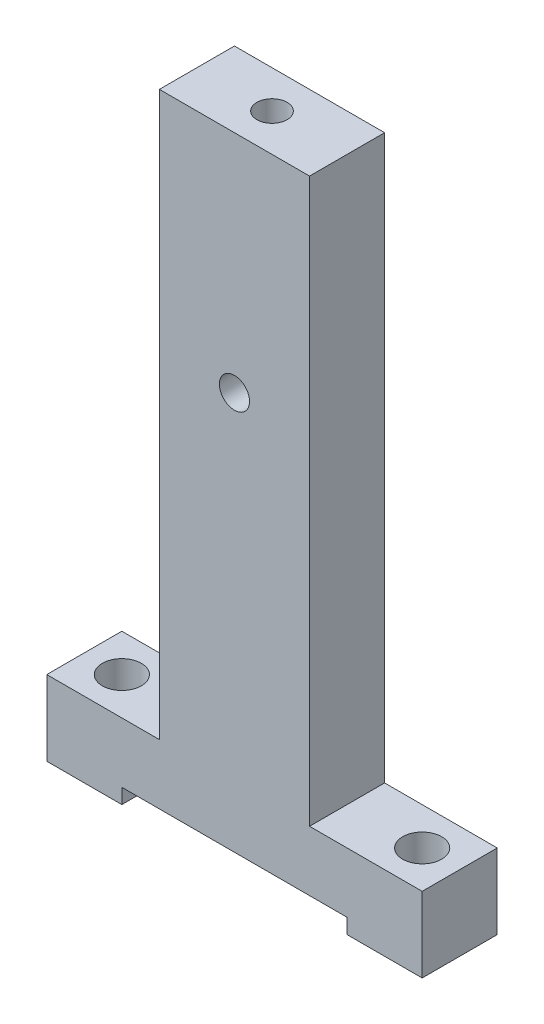
ISO-10303-21;
HEADER;
FILE_DESCRIPTION(('STEP AP214'),'2;1');
FILE_NAME('part.step','',(''),(''),'','','');
FILE_SCHEMA(('AUTOMOTIVE_DESIGN { 1 0 10303 214 1 1 1 1 }'));
ENDSEC;
DATA;
#1=APPLICATION_CONTEXT('core data for automotive mechanical design processes');
#2=APPLICATION_PROTOCOL_DEFINITION('international standard','automotive_design',2000,#1);
#3=PRODUCT_CONTEXT('',#1,'mechanical');
#4=PRODUCT('Part','Part','',(#3));
#5=PRODUCT_RELATED_PRODUCT_CATEGORY('part','',(#4));
#6=PRODUCT_DEFINITION_FORMATION('','',#4);
#7=PRODUCT_DEFINITION_CONTEXT('part definition',#1,'design');
#8=PRODUCT_DEFINITION('design','',#6,#7);
#9=PRODUCT_DEFINITION_SHAPE('','',#8);
#10=(LENGTH_UNIT() NAMED_UNIT(*) SI_UNIT(.MILLI.,.METRE.));
#11=(NAMED_UNIT(*) PLANE_ANGLE_UNIT() SI_UNIT($,.RADIAN.));
#12=(NAMED_UNIT(*) SI_UNIT($,.STERADIAN.) SOLID_ANGLE_UNIT());
#13=UNCERTAINTY_MEASURE_WITH_UNIT(LENGTH_MEASURE(1.E-05),#10,'distance_accuracy_value','');
#14=(GEOMETRIC_REPRESENTATION_CONTEXT(3) GLOBAL_UNCERTAINTY_ASSIGNED_CONTEXT((#13)) GLOBAL_UNIT_ASSIGNED_CONTEXT((#10,
#11,#12)) REPRESENTATION_CONTEXT('',''));
#15=CARTESIAN_POINT('',(0.,0.,0.));
#16=DIRECTION('',(0.,0.,1.));
#17=DIRECTION('',(1.,0.,0.));
#18=AXIS2_PLACEMENT_3D('',#15,#16,#17);
#19=CARTESIAN_POINT('',(0.,-53.975,0.));
#20=DIRECTION('',(0.,1.,0.));
#21=DIRECTION('',(0.,0.,1.));
#22=AXIS2_PLACEMENT_3D('',#19,#20,#21);
#23=PLANE('',#22);
#24=CARTESIAN_POINT('',(-25.4,-53.975,0.));
#25=DIRECTION('',(0.,1.,0.));
#26=DIRECTION('',(0.,0.,1.));
#27=AXIS2_PLACEMENT_3D('',#24,#25,#26);
#28=CIRCLE('',#27,3.302);
#29=CARTESIAN_POINT('',(-25.4,-53.975,3.302));
#30=VERTEX_POINT('',#29);
#31=EDGE_CURVE('E195',#30,#30,#28,.T.);
#32=ORIENTED_EDGE('',*,*,#31,.T.);
#33=EDGE_LOOP('',(#32));
#34=FACE_BOUND('',#33,.T.);
#35=DIRECTION('',(-1.,0.,0.));
#36=VECTOR('',#35,1.);
#37=CARTESIAN_POINT('',(-31.75,-53.975,-6.35));
#38=LINE('',#37,#36);
#39=CARTESIAN_POINT('',(-19.05,-53.975,-6.35));
#40=VERTEX_POINT('',#39);
#41=CARTESIAN_POINT('',(-31.75,-53.975,-6.35));
#42=VERTEX_POINT('',#41);
#43=EDGE_CURVE('E147',#40,#42,#38,.T.);
#44=ORIENTED_EDGE('',*,*,#43,.F.);
#45=DIRECTION('',(0.,0.,1.));
#46=VECTOR('',#45,1.);
#47=CARTESIAN_POINT('',(-19.05,-53.975,-6.35));
#48=LINE('',#47,#46);
#49=CARTESIAN_POINT('',(-19.05,-53.975,6.35));
#50=VERTEX_POINT('',#49);
#51=EDGE_CURVE('E130',#40,#50,#48,.T.);
#52=ORIENTED_EDGE('',*,*,#51,.T.);
#53=DIRECTION('',(1.,0.,0.));
#54=VECTOR('',#53,1.);
#55=CARTESIAN_POINT('',(-31.75,-53.975,6.35));
#56=LINE('',#55,#54);
#57=CARTESIAN_POINT('',(-31.75,-53.975,6.35));
#58=VERTEX_POINT('',#57);
#59=EDGE_CURVE('E161',#58,#50,#56,.T.);
#60=ORIENTED_EDGE('',*,*,#59,.F.);
#61=DIRECTION('',(0.,0.,1.));
#62=VECTOR('',#61,1.);
#63=CARTESIAN_POINT('',(-31.75,-53.975,-6.35));
#64=LINE('',#63,#62);
#65=EDGE_CURVE('E154',#42,#58,#64,.T.);
#66=ORIENTED_EDGE('',*,*,#65,.F.);
#67=EDGE_LOOP('',(#44,#52,#60,#66));
#68=FACE_BOUND('',#67,.T.);
#69=ADVANCED_FACE('F38',(#34,#68),#23,.F.);
#70=CARTESIAN_POINT('',(-31.75,53.975,-6.35));
#71=DIRECTION('',(1.,0.,0.));
#72=DIRECTION('',(0.,0.,-1.));
#73=AXIS2_PLACEMENT_3D('',#70,#71,#72);
#74=PLANE('',#73);
#75=DIRECTION('',(0.,-1.,0.));
#76=VECTOR('',#75,1.);
#77=CARTESIAN_POINT('',(-31.75,53.975,6.35));
#78=LINE('',#77,#76);
#79=CARTESIAN_POINT('',(-31.75,-41.275,6.35));
#80=VERTEX_POINT('',#79);
#81=EDGE_CURVE('E11',#80,#58,#78,.T.);
#82=ORIENTED_EDGE('',*,*,#81,.F.);
#83=DIRECTION('',(0.,0.,1.));
#84=VECTOR('',#83,1.);
#85=CARTESIAN_POINT('',(-31.75,-41.275,-6.351));
#86=LINE('',#85,#84);
#87=CARTESIAN_POINT('',(-31.75,-41.275,-6.35));
#88=VERTEX_POINT('',#87);
#89=EDGE_CURVE('E213',#88,#80,#86,.T.);
#90=ORIENTED_EDGE('',*,*,#89,.F.);
#91=DIRECTION('',(0.,-1.,0.));
#92=VECTOR('',#91,1.);
#93=CARTESIAN_POINT('',(-31.75,53.975,-6.35));
#94=LINE('',#93,#92);
#95=EDGE_CURVE('E165',#88,#42,#94,.T.);
#96=ORIENTED_EDGE('',*,*,#95,.T.);
#97=ORIENTED_EDGE('',*,*,#65,.T.);
#98=EDGE_LOOP('',(#82,#90,#96,#97));
#99=FACE_BOUND('',#98,.T.);
#100=ADVANCED_FACE('F40',(#99),#74,.F.);
#101=CARTESIAN_POINT('',(-31.75,53.975,6.35));
#102=DIRECTION('',(0.,0.,-1.));
#103=DIRECTION('',(-1.,0.,0.));
#104=AXIS2_PLACEMENT_3D('',#101,#102,#103);
#105=PLANE('',#104);
#106=CARTESIAN_POINT('',(0.,15.875,6.35));
#107=DIRECTION('',(0.,0.,1.));
#108=DIRECTION('',(1.,0.,0.));
#109=AXIS2_PLACEMENT_3D('',#106,#107,#108);
#110=CIRCLE('',#109,2.55269999999999);
#111=CARTESIAN_POINT('',(2.55269999999999,15.875,6.35));
#112=VERTEX_POINT('',#111);
#113=EDGE_CURVE('E341',#112,#112,#110,.T.);
#114=ORIENTED_EDGE('',*,*,#113,.F.);
#115=EDGE_LOOP('',(#114));
#116=FACE_BOUND('',#115,.T.);
#117=ORIENTED_EDGE('',*,*,#59,.T.);
#118=DIRECTION('',(0.,-1.,0.));
#119=VECTOR('',#118,1.);
#120=CARTESIAN_POINT('',(-19.05,-53.975,6.35));
#121=LINE('',#120,#119);
#122=CARTESIAN_POINT('',(-19.05,-51.435,6.35));
#123=VERTEX_POINT('',#122);
#124=EDGE_CURVE('E136',#123,#50,#121,.T.);
#125=ORIENTED_EDGE('',*,*,#124,.F.);
#126=DIRECTION('',(-1.,0.,0.));
#127=VECTOR('',#126,1.);
#128=CARTESIAN_POINT('',(-19.05,-51.435,6.35));
#129=LINE('',#128,#127);
#130=CARTESIAN_POINT('',(19.05,-51.435,6.35));
#131=VERTEX_POINT('',#130);
#132=EDGE_CURVE('E150',#131,#123,#129,.T.);
#133=ORIENTED_EDGE('',*,*,#132,.F.);
#134=DIRECTION('',(0.,1.,0.));
#135=VECTOR('',#134,1.);
#136=CARTESIAN_POINT('',(19.05,-53.975,6.35));
#137=LINE('',#136,#135);
#138=CARTESIAN_POINT('',(19.05,-53.975,6.35));
#139=VERTEX_POINT('',#138);
#140=EDGE_CURVE('E229',#139,#131,#137,.T.);
#141=ORIENTED_EDGE('',*,*,#140,.F.);
#142=CARTESIAN_POINT('',(31.75,-53.975,6.35));
#143=VERTEX_POINT('',#142);
#144=EDGE_CURVE('E184',#139,#143,#56,.T.);
#145=ORIENTED_EDGE('',*,*,#144,.T.);
#146=DIRECTION('',(0.,-1.,0.));
#147=VECTOR('',#146,1.);
#148=CARTESIAN_POINT('',(31.75,53.975,6.35));
#149=LINE('',#148,#147);
#150=CARTESIAN_POINT('',(31.75,-41.275,6.35));
#151=VERTEX_POINT('',#150);
#152=EDGE_CURVE('E47',#151,#143,#149,.T.);
#153=ORIENTED_EDGE('',*,*,#152,.F.);
#154=DIRECTION('',(1.,0.,0.));
#155=VECTOR('',#154,1.);
#156=CARTESIAN_POINT('',(31.75,-41.275,6.35));
#157=LINE('',#156,#155);
#158=CARTESIAN_POINT('',(12.7,-41.275,6.35));
#159=VERTEX_POINT('',#158);
#160=EDGE_CURVE('E193',#159,#151,#157,.T.);
#161=ORIENTED_EDGE('',*,*,#160,.F.);
#162=DIRECTION('',(0.,-1.,0.));
#163=VECTOR('',#162,1.);
#164=CARTESIAN_POINT('',(12.7,53.975,6.35));
#165=LINE('',#164,#163);
#166=CARTESIAN_POINT('',(12.7,53.975,6.35));
#167=VERTEX_POINT('',#166);
#168=EDGE_CURVE('E190',#167,#159,#165,.T.);
#169=ORIENTED_EDGE('',*,*,#168,.F.);
#170=DIRECTION('',(1.,0.,0.));
#171=VECTOR('',#170,1.);
#172=CARTESIAN_POINT('',(-31.75,53.975,6.35));
#173=LINE('',#172,#171);
#174=CARTESIAN_POINT('',(-12.7,53.975,6.35));
#175=VERTEX_POINT('',#174);
#176=EDGE_CURVE('E159',#175,#167,#173,.T.);
#177=ORIENTED_EDGE('',*,*,#176,.F.);
#178=DIRECTION('',(0.,1.,0.));
#179=VECTOR('',#178,1.);
#180=CARTESIAN_POINT('',(-12.7,53.975,6.35));
#181=LINE('',#180,#179);
#182=CARTESIAN_POINT('',(-12.7,-41.275,6.35));
#183=VERTEX_POINT('',#182);
#184=EDGE_CURVE('E211',#183,#175,#181,.T.);
#185=ORIENTED_EDGE('',*,*,#184,.F.);
#186=DIRECTION('',(1.,0.,0.));
#187=VECTOR('',#186,1.);
#188=CARTESIAN_POINT('',(-31.75,-41.275,6.35));
#189=LINE('',#188,#187);
#190=EDGE_CURVE('E208',#80,#183,#189,.T.);
#191=ORIENTED_EDGE('',*,*,#190,.F.);
#192=ORIENTED_EDGE('',*,*,#81,.T.);
#193=EDGE_LOOP('',(#117,#125,#133,#141,#145,#153,#161,#169,#177,#185,#191,#192));
#194=FACE_BOUND('',#193,.T.);
#195=ADVANCED_FACE('F226',(#116,#194),#105,.F.);
#196=CARTESIAN_POINT('',(31.75,53.975,-6.35));
#197=DIRECTION('',(-1.,0.,0.));
#198=DIRECTION('',(0.,0.,1.));
#199=AXIS2_PLACEMENT_3D('',#196,#197,#198);
#200=PLANE('',#199);
#201=DIRECTION('',(0.,-1.,0.));
#202=VECTOR('',#201,1.);
#203=CARTESIAN_POINT('',(31.75,53.975,-6.35));
#204=LINE('',#203,#202);
#205=CARTESIAN_POINT('',(31.75,-41.275,-6.35));
#206=VERTEX_POINT('',#205);
#207=CARTESIAN_POINT('',(31.75,-53.975,-6.35));
#208=VERTEX_POINT('',#207);
#209=EDGE_CURVE('E167',#206,#208,#204,.T.);
#210=ORIENTED_EDGE('',*,*,#209,.F.);
#211=DIRECTION('',(0.,0.,1.));
#212=VECTOR('',#211,1.);
#213=CARTESIAN_POINT('',(31.75,-41.275,-6.351));
#214=LINE('',#213,#212);
#215=EDGE_CURVE('E178',#206,#151,#214,.T.);
#216=ORIENTED_EDGE('',*,*,#215,.T.);
#217=ORIENTED_EDGE('',*,*,#152,.T.);
#218=DIRECTION('',(0.,0.,-1.));
#219=VECTOR('',#218,1.);
#220=CARTESIAN_POINT('',(31.75,-53.975,-6.35));
#221=LINE('',#220,#219);
#222=EDGE_CURVE('E156',#143,#208,#221,.T.);
#223=ORIENTED_EDGE('',*,*,#222,.T.);
#224=EDGE_LOOP('',(#210,#216,#217,#223));
#225=FACE_BOUND('',#224,.T.);
#226=ADVANCED_FACE('F176',(#225),#200,.F.);
#227=CARTESIAN_POINT('',(-31.75,53.975,-6.35));
#228=DIRECTION('',(0.,0.,1.));
#229=DIRECTION('',(1.,0.,0.));
#230=AXIS2_PLACEMENT_3D('',#227,#228,#229);
#231=PLANE('',#230);
#232=CARTESIAN_POINT('',(0.,15.875,-6.35));
#233=DIRECTION('',(0.,0.,1.));
#234=DIRECTION('',(1.,0.,0.));
#235=AXIS2_PLACEMENT_3D('',#232,#233,#234);
#236=CIRCLE('',#235,2.55269999999999);
#237=CARTESIAN_POINT('',(2.55269999999999,15.875,-6.35));
#238=VERTEX_POINT('',#237);
#239=EDGE_CURVE('E42',#238,#238,#236,.T.);
#240=ORIENTED_EDGE('',*,*,#239,.T.);
#241=EDGE_LOOP('',(#240));
#242=FACE_BOUND('',#241,.T.);
#243=DIRECTION('',(-1.,0.,0.));
#244=VECTOR('',#243,1.);
#245=CARTESIAN_POINT('',(-19.05,-51.435,-6.35));
#246=LINE('',#245,#244);
#247=CARTESIAN_POINT('',(19.05,-51.435,-6.35));
#248=VERTEX_POINT('',#247);
#249=CARTESIAN_POINT('',(-19.05,-51.435,-6.35));
#250=VERTEX_POINT('',#249);
#251=EDGE_CURVE('E142',#248,#250,#246,.T.);
#252=ORIENTED_EDGE('',*,*,#251,.T.);
#253=DIRECTION('',(0.,-1.,0.));
#254=VECTOR('',#253,1.);
#255=CARTESIAN_POINT('',(-19.05,-53.975,-6.35));
#256=LINE('',#255,#254);
#257=EDGE_CURVE('E133',#250,#40,#256,.T.);
#258=ORIENTED_EDGE('',*,*,#257,.T.);
#259=ORIENTED_EDGE('',*,*,#43,.T.);
#260=ORIENTED_EDGE('',*,*,#95,.F.);
#261=DIRECTION('',(-1.,0.,0.));
#262=VECTOR('',#261,1.);
#263=CARTESIAN_POINT('',(-31.75,-41.275,-6.35));
#264=LINE('',#263,#262);
#265=CARTESIAN_POINT('',(-12.7,-41.275,-6.35));
#266=VERTEX_POINT('',#265);
#267=EDGE_CURVE('E217',#266,#88,#264,.T.);
#268=ORIENTED_EDGE('',*,*,#267,.F.);
#269=DIRECTION('',(0.,-1.,0.));
#270=VECTOR('',#269,1.);
#271=CARTESIAN_POINT('',(-12.7,53.975,-6.35));
#272=LINE('',#271,#270);
#273=CARTESIAN_POINT('',(-12.7,53.975,-6.35));
#274=VERTEX_POINT('',#273);
#275=EDGE_CURVE('E202',#274,#266,#272,.T.);
#276=ORIENTED_EDGE('',*,*,#275,.F.);
#277=DIRECTION('',(-1.,0.,0.));
#278=VECTOR('',#277,1.);
#279=CARTESIAN_POINT('',(-31.75,53.975,-6.35));
#280=LINE('',#279,#278);
#281=CARTESIAN_POINT('',(12.7,53.975,-6.35));
#282=VERTEX_POINT('',#281);
#283=EDGE_CURVE('E168',#282,#274,#280,.T.);
#284=ORIENTED_EDGE('',*,*,#283,.F.);
#285=DIRECTION('',(0.,1.,0.));
#286=VECTOR('',#285,1.);
#287=CARTESIAN_POINT('',(12.7,53.975,-6.35));
#288=LINE('',#287,#286);
#289=CARTESIAN_POINT('',(12.7,-41.275,-6.35));
#290=VERTEX_POINT('',#289);
#291=EDGE_CURVE('E62',#290,#282,#288,.T.);
#292=ORIENTED_EDGE('',*,*,#291,.F.);
#293=DIRECTION('',(-1.,0.,0.));
#294=VECTOR('',#293,1.);
#295=CARTESIAN_POINT('',(31.75,-41.275,-6.35));
#296=LINE('',#295,#294);
#297=EDGE_CURVE('E187',#206,#290,#296,.T.);
#298=ORIENTED_EDGE('',*,*,#297,.F.);
#299=ORIENTED_EDGE('',*,*,#209,.T.);
#300=CARTESIAN_POINT('',(19.05,-53.975,-6.35));
#301=VERTEX_POINT('',#300);
#302=EDGE_CURVE('E155',#208,#301,#38,.T.);
#303=ORIENTED_EDGE('',*,*,#302,.T.);
#304=DIRECTION('',(0.,1.,0.));
#305=VECTOR('',#304,1.);
#306=CARTESIAN_POINT('',(19.05,-53.975,-6.35));
#307=LINE('',#306,#305);
#308=EDGE_CURVE('E54',#301,#248,#307,.T.);
#309=ORIENTED_EDGE('',*,*,#308,.T.);
#310=EDGE_LOOP('',(#252,#258,#259,#260,#268,#276,#284,#292,#298,#299,#303,#309));
#311=FACE_BOUND('',#310,.T.);
#312=ADVANCED_FACE('F145',(#242,#311),#231,.F.);
#313=CARTESIAN_POINT('',(0.,53.975,0.));
#314=DIRECTION('',(0.,1.,0.));
#315=DIRECTION('',(0.,0.,1.));
#316=AXIS2_PLACEMENT_3D('',#313,#314,#315);
#317=PLANE('',#316);
#318=CARTESIAN_POINT('',(0.,53.975,0.));
#319=DIRECTION('',(0.,1.,0.));
#320=DIRECTION('',(0.,0.,1.));
#321=AXIS2_PLACEMENT_3D('',#318,#319,#320);
#322=CIRCLE('',#321,2.55269999999999);
#323=CARTESIAN_POINT('',(0.,53.975,2.55269999999999));
#324=VERTEX_POINT('',#323);
#325=EDGE_CURVE('E238',#324,#324,#322,.T.);
#326=ORIENTED_EDGE('',*,*,#325,.F.);
#327=EDGE_LOOP('',(#326));
#328=FACE_BOUND('',#327,.T.);
#329=DIRECTION('',(0.,0.,1.));
#330=VECTOR('',#329,1.);
#331=CARTESIAN_POINT('',(12.7,53.975,-6.351));
#332=LINE('',#331,#330);
#333=EDGE_CURVE('E200',#282,#167,#332,.T.);
#334=ORIENTED_EDGE('',*,*,#333,.F.);
#335=ORIENTED_EDGE('',*,*,#283,.T.);
#336=DIRECTION('',(0.,0.,1.));
#337=VECTOR('',#336,1.);
#338=CARTESIAN_POINT('',(-12.7,53.975,-6.351));
#339=LINE('',#338,#337);
#340=EDGE_CURVE('E214',#274,#175,#339,.T.);
#341=ORIENTED_EDGE('',*,*,#340,.T.);
#342=ORIENTED_EDGE('',*,*,#176,.T.);
#343=EDGE_LOOP('',(#334,#335,#341,#342));
#344=FACE_BOUND('',#343,.T.);
#345=ADVANCED_FACE('F278',(#328,#344),#317,.T.);
#346=CARTESIAN_POINT('',(25.4,-53.975,0.));
#347=DIRECTION('',(0.,1.,0.));
#348=DIRECTION('',(0.,0.,1.));
#349=AXIS2_PLACEMENT_3D('',#346,#347,#348);
#350=CIRCLE('',#349,3.302);
#351=CARTESIAN_POINT('',(25.4,-53.975,3.30199999999999));
#352=VERTEX_POINT('',#351);
#353=EDGE_CURVE('E248',#352,#352,#350,.T.);
#354=ORIENTED_EDGE('',*,*,#353,.T.);
#355=EDGE_LOOP('',(#354));
#356=FACE_BOUND('',#355,.T.);
#357=ORIENTED_EDGE('',*,*,#144,.F.);
#358=DIRECTION('',(0.,0.,1.));
#359=VECTOR('',#358,1.);
#360=CARTESIAN_POINT('',(19.05,-53.975,-6.35));
#361=LINE('',#360,#359);
#362=EDGE_CURVE('E141',#301,#139,#361,.T.);
#363=ORIENTED_EDGE('',*,*,#362,.F.);
#364=ORIENTED_EDGE('',*,*,#302,.F.);
#365=ORIENTED_EDGE('',*,*,#222,.F.);
#366=EDGE_LOOP('',(#357,#363,#364,#365));
#367=FACE_BOUND('',#366,.T.);
#368=ADVANCED_FACE('F183',(#356,#367),#23,.F.);
#369=CARTESIAN_POINT('',(-12.7,53.975,-6.351));
#370=DIRECTION('',(1.,0.,0.));
#371=DIRECTION('',(0.,1.,0.));
#372=AXIS2_PLACEMENT_3D('',#369,#370,#371);
#373=PLANE('',#372);
#374=ORIENTED_EDGE('',*,*,#275,.T.);
#375=DIRECTION('',(0.,0.,1.));
#376=VECTOR('',#375,1.);
#377=CARTESIAN_POINT('',(-12.7,-41.275,-6.351));
#378=LINE('',#377,#376);
#379=EDGE_CURVE('E218',#266,#183,#378,.T.);
#380=ORIENTED_EDGE('',*,*,#379,.T.);
#381=ORIENTED_EDGE('',*,*,#184,.T.);
#382=ORIENTED_EDGE('',*,*,#340,.F.);
#383=EDGE_LOOP('',(#374,#380,#381,#382));
#384=FACE_BOUND('',#383,.T.);
#385=ADVANCED_FACE('F264',(#384),#373,.F.);
#386=CARTESIAN_POINT('',(-31.75,-41.275,-6.351));
#387=DIRECTION('',(0.,-1.,0.));
#388=DIRECTION('',(0.,0.,-1.));
#389=AXIS2_PLACEMENT_3D('',#386,#387,#388);
#390=PLANE('',#389);
#391=CARTESIAN_POINT('',(-25.4,-41.275,0.));
#392=DIRECTION('',(0.,1.,0.));
#393=DIRECTION('',(0.,0.,1.));
#394=AXIS2_PLACEMENT_3D('',#391,#392,#393);
#395=CIRCLE('',#394,3.302);
#396=CARTESIAN_POINT('',(-25.4,-41.275,3.302));
#397=VERTEX_POINT('',#396);
#398=EDGE_CURVE('E251',#397,#397,#395,.T.);
#399=ORIENTED_EDGE('',*,*,#398,.F.);
#400=EDGE_LOOP('',(#399));
#401=FACE_BOUND('',#400,.T.);
#402=ORIENTED_EDGE('',*,*,#267,.T.);
#403=ORIENTED_EDGE('',*,*,#89,.T.);
#404=ORIENTED_EDGE('',*,*,#190,.T.);
#405=ORIENTED_EDGE('',*,*,#379,.F.);
#406=EDGE_LOOP('',(#402,#403,#404,#405));
#407=FACE_BOUND('',#406,.T.);
#408=ADVANCED_FACE('F260',(#401,#407),#390,.F.);
#409=CARTESIAN_POINT('',(31.75,-41.275,-6.351));
#410=DIRECTION('',(0.,-1.,0.));
#411=DIRECTION('',(1.,0.,0.));
#412=AXIS2_PLACEMENT_3D('',#409,#410,#411);
#413=PLANE('',#412);
#414=CARTESIAN_POINT('',(25.4,-41.275,0.));
#415=DIRECTION('',(0.,1.,0.));
#416=DIRECTION('',(0.,0.,1.));
#417=AXIS2_PLACEMENT_3D('',#414,#415,#416);
#418=CIRCLE('',#417,3.302);
#419=CARTESIAN_POINT('',(25.4,-41.275,3.30199999999999));
#420=VERTEX_POINT('',#419);
#421=EDGE_CURVE('E247',#420,#420,#418,.T.);
#422=ORIENTED_EDGE('',*,*,#421,.F.);
#423=EDGE_LOOP('',(#422));
#424=FACE_BOUND('',#423,.T.);
#425=ORIENTED_EDGE('',*,*,#297,.T.);
#426=DIRECTION('',(0.,0.,1.));
#427=VECTOR('',#426,1.);
#428=CARTESIAN_POINT('',(12.7,-41.275,-6.351));
#429=LINE('',#428,#427);
#430=EDGE_CURVE('E203',#290,#159,#429,.T.);
#431=ORIENTED_EDGE('',*,*,#430,.T.);
#432=ORIENTED_EDGE('',*,*,#160,.T.);
#433=ORIENTED_EDGE('',*,*,#215,.F.);
#434=EDGE_LOOP('',(#425,#431,#432,#433));
#435=FACE_BOUND('',#434,.T.);
#436=ADVANCED_FACE('F263',(#424,#435),#413,.F.);
#437=CARTESIAN_POINT('',(12.7,53.975,-6.351));
#438=DIRECTION('',(-1.,0.,0.));
#439=DIRECTION('',(0.,-1.,0.));
#440=AXIS2_PLACEMENT_3D('',#437,#438,#439);
#441=PLANE('',#440);
#442=ORIENTED_EDGE('',*,*,#291,.T.);
#443=ORIENTED_EDGE('',*,*,#333,.T.);
#444=ORIENTED_EDGE('',*,*,#168,.T.);
#445=ORIENTED_EDGE('',*,*,#430,.F.);
#446=EDGE_LOOP('',(#442,#443,#444,#445));
#447=FACE_BOUND('',#446,.T.);
#448=ADVANCED_FACE('F279',(#447),#441,.F.);
#449=CARTESIAN_POINT('',(-25.4,-53.975,0.));
#450=DIRECTION('',(0.,1.,0.));
#451=DIRECTION('',(0.,0.,1.));
#452=AXIS2_PLACEMENT_3D('',#449,#450,#451);
#453=CYLINDRICAL_SURFACE('',#452,3.302);
#454=ORIENTED_EDGE('',*,*,#31,.F.);
#455=EDGE_LOOP('',(#454));
#456=FACE_BOUND('',#455,.T.);
#457=ORIENTED_EDGE('',*,*,#398,.T.);
#458=EDGE_LOOP('',(#457));
#459=FACE_BOUND('',#458,.T.);
#460=ADVANCED_FACE('F258',(#456,#459),#453,.F.);
#461=CARTESIAN_POINT('',(25.4,-53.975,0.));
#462=DIRECTION('',(0.,1.,0.));
#463=DIRECTION('',(0.,0.,1.));
#464=AXIS2_PLACEMENT_3D('',#461,#462,#463);
#465=CYLINDRICAL_SURFACE('',#464,3.302);
#466=ORIENTED_EDGE('',*,*,#353,.F.);
#467=EDGE_LOOP('',(#466));
#468=FACE_BOUND('',#467,.T.);
#469=ORIENTED_EDGE('',*,*,#421,.T.);
#470=EDGE_LOOP('',(#469));
#471=FACE_BOUND('',#470,.T.);
#472=ADVANCED_FACE('F307',(#468,#471),#465,.F.);
#473=CARTESIAN_POINT('',(0.,34.925,0.));
#474=DIRECTION('',(0.,1.,0.));
#475=DIRECTION('',(0.,0.,1.));
#476=AXIS2_PLACEMENT_3D('',#473,#474,#475);
#477=CONICAL_SURFACE('',#476,2.55269999999999,1.02974425867665);
#478=CARTESIAN_POINT('',(0.,33.3911830978083,0.));
#479=VERTEX_POINT('',#478);
#480=VERTEX_LOOP('',#479);
#481=FACE_BOUND('',#480,.T.);
#482=CARTESIAN_POINT('',(0.,34.925,0.));
#483=DIRECTION('',(0.,1.,0.));
#484=DIRECTION('',(0.,0.,1.));
#485=AXIS2_PLACEMENT_3D('',#482,#483,#484);
#486=CIRCLE('',#485,2.55269999999999);
#487=CARTESIAN_POINT('',(0.,34.925,2.55269999999999));
#488=VERTEX_POINT('',#487);
#489=EDGE_CURVE('E244',#488,#488,#486,.T.);
#490=ORIENTED_EDGE('',*,*,#489,.T.);
#491=EDGE_LOOP('',(#490));
#492=FACE_BOUND('',#491,.T.);
#493=ADVANCED_FACE('F310',(#481,#492),#477,.F.);
#494=CARTESIAN_POINT('',(0.,53.975,0.));
#495=DIRECTION('',(0.,1.,0.));
#496=DIRECTION('',(0.,0.,1.));
#497=AXIS2_PLACEMENT_3D('',#494,#495,#496);
#498=CYLINDRICAL_SURFACE('',#497,2.55269999999999);
#499=ORIENTED_EDGE('',*,*,#489,.F.);
#500=EDGE_LOOP('',(#499));
#501=FACE_BOUND('',#500,.T.);
#502=ORIENTED_EDGE('',*,*,#325,.T.);
#503=EDGE_LOOP('',(#502));
#504=FACE_BOUND('',#503,.T.);
#505=ADVANCED_FACE('F316',(#501,#504),#498,.F.);
#506=CARTESIAN_POINT('',(-19.05,-53.975,-6.35));
#507=DIRECTION('',(-1.,0.,0.));
#508=DIRECTION('',(0.,0.,1.));
#509=AXIS2_PLACEMENT_3D('',#506,#507,#508);
#510=PLANE('',#509);
#511=ORIENTED_EDGE('',*,*,#124,.T.);
#512=ORIENTED_EDGE('',*,*,#51,.F.);
#513=ORIENTED_EDGE('',*,*,#257,.F.);
#514=DIRECTION('',(0.,0.,1.));
#515=VECTOR('',#514,1.);
#516=CARTESIAN_POINT('',(-19.05,-51.435,-6.35));
#517=LINE('',#516,#515);
#518=EDGE_CURVE('E236',#250,#123,#517,.T.);
#519=ORIENTED_EDGE('',*,*,#518,.T.);
#520=EDGE_LOOP('',(#511,#512,#513,#519));
#521=FACE_BOUND('',#520,.T.);
#522=ADVANCED_FACE('F132',(#521),#510,.F.);
#523=CARTESIAN_POINT('',(-19.05,-51.435,-6.35));
#524=DIRECTION('',(0.,1.,0.));
#525=DIRECTION('',(0.,0.,1.));
#526=AXIS2_PLACEMENT_3D('',#523,#524,#525);
#527=PLANE('',#526);
#528=ORIENTED_EDGE('',*,*,#132,.T.);
#529=ORIENTED_EDGE('',*,*,#518,.F.);
#530=ORIENTED_EDGE('',*,*,#251,.F.);
#531=DIRECTION('',(0.,0.,1.));
#532=VECTOR('',#531,1.);
#533=CARTESIAN_POINT('',(19.05,-51.435,-6.35));
#534=LINE('',#533,#532);
#535=EDGE_CURVE('E239',#248,#131,#534,.T.);
#536=ORIENTED_EDGE('',*,*,#535,.T.);
#537=EDGE_LOOP('',(#528,#529,#530,#536));
#538=FACE_BOUND('',#537,.T.);
#539=ADVANCED_FACE('F326',(#538),#527,.F.);
#540=CARTESIAN_POINT('',(19.05,-53.975,-6.35));
#541=DIRECTION('',(1.,0.,0.));
#542=DIRECTION('',(0.,0.,-1.));
#543=AXIS2_PLACEMENT_3D('',#540,#541,#542);
#544=PLANE('',#543);
#545=ORIENTED_EDGE('',*,*,#140,.T.);
#546=ORIENTED_EDGE('',*,*,#535,.F.);
#547=ORIENTED_EDGE('',*,*,#308,.F.);
#548=ORIENTED_EDGE('',*,*,#362,.T.);
#549=EDGE_LOOP('',(#545,#546,#547,#548));
#550=FACE_BOUND('',#549,.T.);
#551=ADVANCED_FACE('F327',(#550),#544,.F.);
#552=CARTESIAN_POINT('',(0.,15.875,6.35));
#553=DIRECTION('',(0.,0.,1.));
#554=DIRECTION('',(1.,0.,0.));
#555=AXIS2_PLACEMENT_3D('',#552,#553,#554);
#556=CYLINDRICAL_SURFACE('',#555,2.55269999999999);
#557=ORIENTED_EDGE('',*,*,#113,.T.);
#558=EDGE_LOOP('',(#557));
#559=FACE_BOUND('',#558,.T.);
#560=ORIENTED_EDGE('',*,*,#239,.F.);
#561=EDGE_LOOP('',(#560));
#562=FACE_BOUND('',#561,.T.);
#563=ADVANCED_FACE('F330',(#559,#562),#556,.F.);
#564=CLOSED_SHELL('',(#69,#100,#195,#226,#312,#345,#368,#385,#408,#436,#448,#460,#472,#493,#505,
#522,#539,#551,#563));
#565=MANIFOLD_SOLID_BREP('B2',#564);
#566=ADVANCED_BREP_SHAPE_REPRESENTATION('',(#18,#565),#14);
#567=SHAPE_DEFINITION_REPRESENTATION(#9,#566);
ENDSEC;
END-ISO-10303-21;
